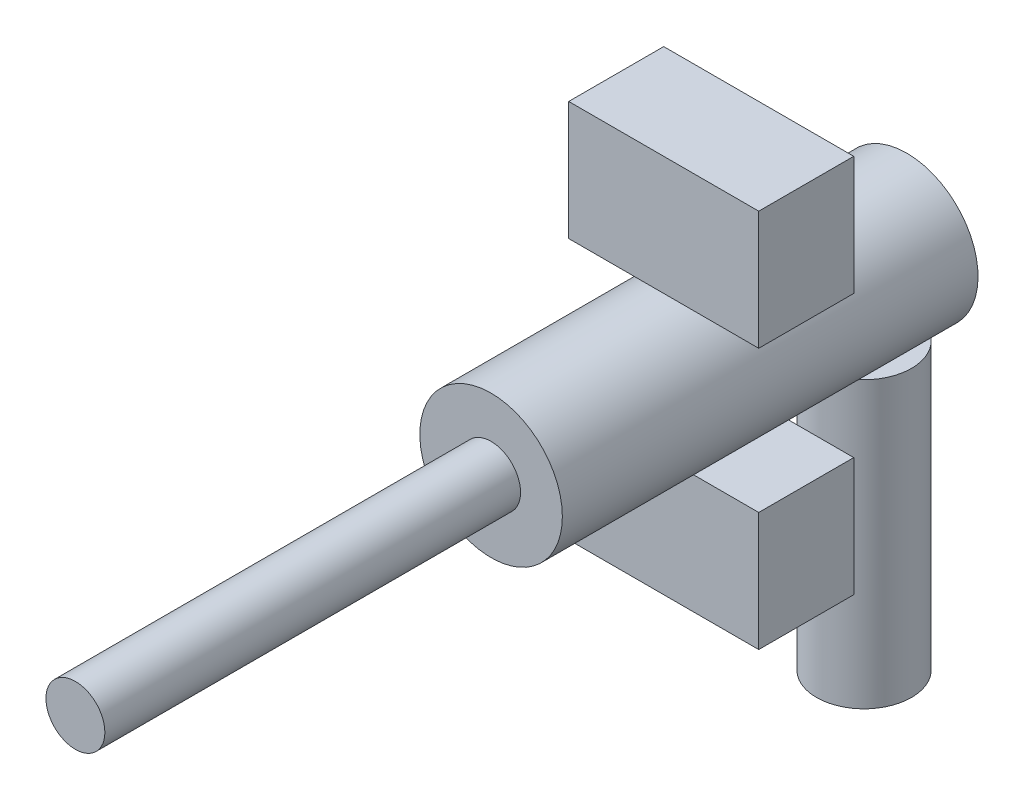
ISO-10303-21;
HEADER;
FILE_DESCRIPTION(('STEP AP214'),'2;1');
FILE_NAME('part.step','',(''),(''),'','','');
FILE_SCHEMA(('AUTOMOTIVE_DESIGN { 1 0 10303 214 1 1 1 1 }'));
ENDSEC;
DATA;
#1=APPLICATION_CONTEXT('core data for automotive mechanical design processes');
#2=APPLICATION_PROTOCOL_DEFINITION('international standard','automotive_design',2000,#1);
#3=PRODUCT_CONTEXT('',#1,'mechanical');
#4=PRODUCT('Part','Part','',(#3));
#5=PRODUCT_RELATED_PRODUCT_CATEGORY('part','',(#4));
#6=PRODUCT_DEFINITION_FORMATION('','',#4);
#7=PRODUCT_DEFINITION_CONTEXT('part definition',#1,'design');
#8=PRODUCT_DEFINITION('design','',#6,#7);
#9=PRODUCT_DEFINITION_SHAPE('','',#8);
#10=(LENGTH_UNIT() NAMED_UNIT(*) SI_UNIT(.MILLI.,.METRE.));
#11=(NAMED_UNIT(*) PLANE_ANGLE_UNIT() SI_UNIT($,.RADIAN.));
#12=(NAMED_UNIT(*) SI_UNIT($,.STERADIAN.) SOLID_ANGLE_UNIT());
#13=UNCERTAINTY_MEASURE_WITH_UNIT(LENGTH_MEASURE(1.E-05),#10,'distance_accuracy_value','');
#14=(GEOMETRIC_REPRESENTATION_CONTEXT(3) GLOBAL_UNCERTAINTY_ASSIGNED_CONTEXT((#13)) GLOBAL_UNIT_ASSIGNED_CONTEXT((#10,
#11,#12)) REPRESENTATION_CONTEXT('',''));
#15=CARTESIAN_POINT('',(0.,0.,0.));
#16=DIRECTION('',(0.,0.,1.));
#17=DIRECTION('',(1.,0.,0.));
#18=AXIS2_PLACEMENT_3D('',#15,#16,#17);
#19=CARTESIAN_POINT('',(-40.,179.48753108507,102.321831747482));
#20=DIRECTION('',(0.,0.,1.));
#21=DIRECTION('',(1.,0.,0.));
#22=AXIS2_PLACEMENT_3D('',#19,#20,#21);
#23=PLANE('',#22);
#24=DIRECTION('',(1.,0.,0.));
#25=VECTOR('',#24,1.);
#26=CARTESIAN_POINT('',(-40.,179.48753108507,102.321831747482));
#27=LINE('',#26,#25);
#28=CARTESIAN_POINT('',(-40.,179.48753108507,102.321831747482));
#29=VERTEX_POINT('',#28);
#30=CARTESIAN_POINT('',(40.,179.48753108507,102.321831747482));
#31=VERTEX_POINT('',#30);
#32=EDGE_CURVE('E58',#29,#31,#27,.T.);
#33=ORIENTED_EDGE('',*,*,#32,.T.);
#34=DIRECTION('',(0.,-1.,0.));
#35=VECTOR('',#34,1.);
#36=CARTESIAN_POINT('',(40.,179.48753108507,102.321831747482));
#37=LINE('',#36,#35);
#38=CARTESIAN_POINT('',(40.,229.48753108507,102.321831747482));
#39=VERTEX_POINT('',#38);
#40=EDGE_CURVE('E95',#39,#31,#37,.T.);
#41=ORIENTED_EDGE('',*,*,#40,.F.);
#42=DIRECTION('',(1.,0.,0.));
#43=VECTOR('',#42,1.);
#44=CARTESIAN_POINT('',(-40.,229.48753108507,102.321831747482));
#45=LINE('',#44,#43);
#46=CARTESIAN_POINT('',(-40.,229.48753108507,102.321831747482));
#47=VERTEX_POINT('',#46);
#48=EDGE_CURVE('E12',#47,#39,#45,.T.);
#49=ORIENTED_EDGE('',*,*,#48,.F.);
#50=DIRECTION('',(0.,-1.,0.));
#51=VECTOR('',#50,1.);
#52=CARTESIAN_POINT('',(-40.,179.48753108507,102.321831747482));
#53=LINE('',#52,#51);
#54=EDGE_CURVE('E96',#47,#29,#53,.T.);
#55=ORIENTED_EDGE('',*,*,#54,.T.);
#56=EDGE_LOOP('',(#33,#41,#49,#55));
#57=FACE_BOUND('',#56,.T.);
#58=ADVANCED_FACE('F55',(#57),#23,.T.);
#59=CARTESIAN_POINT('',(-40.,229.48753108507,102.321831747482));
#60=DIRECTION('',(0.,1.,0.));
#61=DIRECTION('',(0.,0.,1.));
#62=AXIS2_PLACEMENT_3D('',#59,#60,#61);
#63=PLANE('',#62);
#64=ORIENTED_EDGE('',*,*,#48,.T.);
#65=DIRECTION('',(0.,0.,1.));
#66=VECTOR('',#65,1.);
#67=CARTESIAN_POINT('',(40.,229.48753108507,102.321831747482));
#68=LINE('',#67,#66);
#69=CARTESIAN_POINT('',(40.,229.48753108507,62.3218317474823));
#70=VERTEX_POINT('',#69);
#71=EDGE_CURVE('E112',#70,#39,#68,.T.);
#72=ORIENTED_EDGE('',*,*,#71,.F.);
#73=DIRECTION('',(1.,0.,0.));
#74=VECTOR('',#73,1.);
#75=CARTESIAN_POINT('',(-40.,229.48753108507,62.3218317474823));
#76=LINE('',#75,#74);
#77=CARTESIAN_POINT('',(-40.,229.48753108507,62.3218317474823));
#78=VERTEX_POINT('',#77);
#79=EDGE_CURVE('E63',#78,#70,#76,.T.);
#80=ORIENTED_EDGE('',*,*,#79,.F.);
#81=DIRECTION('',(0.,0.,1.));
#82=VECTOR('',#81,1.);
#83=CARTESIAN_POINT('',(-40.,229.48753108507,102.321831747482));
#84=LINE('',#83,#82);
#85=EDGE_CURVE('E101',#78,#47,#84,.T.);
#86=ORIENTED_EDGE('',*,*,#85,.T.);
#87=EDGE_LOOP('',(#64,#72,#80,#86));
#88=FACE_BOUND('',#87,.T.);
#89=ADVANCED_FACE('F127',(#88),#63,.T.);
#90=CARTESIAN_POINT('',(-40.,179.48753108507,62.3218317474823));
#91=DIRECTION('',(0.,0.,-1.));
#92=DIRECTION('',(-1.,0.,0.));
#93=AXIS2_PLACEMENT_3D('',#90,#91,#92);
#94=PLANE('',#93);
#95=ORIENTED_EDGE('',*,*,#79,.T.);
#96=DIRECTION('',(0.,1.,0.));
#97=VECTOR('',#96,1.);
#98=CARTESIAN_POINT('',(40.,179.48753108507,62.3218317474823));
#99=LINE('',#98,#97);
#100=CARTESIAN_POINT('',(40.,179.48753108507,62.3218317474823));
#101=VERTEX_POINT('',#100);
#102=EDGE_CURVE('E108',#101,#70,#99,.T.);
#103=ORIENTED_EDGE('',*,*,#102,.F.);
#104=DIRECTION('',(1.,0.,0.));
#105=VECTOR('',#104,1.);
#106=CARTESIAN_POINT('',(-40.,179.48753108507,62.3218317474823));
#107=LINE('',#106,#105);
#108=CARTESIAN_POINT('',(-40.,179.48753108507,62.3218317474823));
#109=VERTEX_POINT('',#108);
#110=EDGE_CURVE('E100',#109,#101,#107,.T.);
#111=ORIENTED_EDGE('',*,*,#110,.F.);
#112=DIRECTION('',(0.,1.,0.));
#113=VECTOR('',#112,1.);
#114=CARTESIAN_POINT('',(-40.,179.48753108507,62.3218317474823));
#115=LINE('',#114,#113);
#116=EDGE_CURVE('E120',#109,#78,#115,.T.);
#117=ORIENTED_EDGE('',*,*,#116,.T.);
#118=EDGE_LOOP('',(#95,#103,#111,#117));
#119=FACE_BOUND('',#118,.T.);
#120=ADVANCED_FACE('F124',(#119),#94,.T.);
#121=CARTESIAN_POINT('',(-40.,179.48753108507,102.321831747482));
#122=DIRECTION('',(0.,-1.,0.));
#123=DIRECTION('',(0.,0.,-1.));
#124=AXIS2_PLACEMENT_3D('',#121,#122,#123);
#125=PLANE('',#124);
#126=ORIENTED_EDGE('',*,*,#110,.T.);
#127=DIRECTION('',(0.,0.,-1.));
#128=VECTOR('',#127,1.);
#129=CARTESIAN_POINT('',(40.,179.48753108507,102.321831747482));
#130=LINE('',#129,#128);
#131=EDGE_CURVE('E103',#31,#101,#130,.T.);
#132=ORIENTED_EDGE('',*,*,#131,.F.);
#133=ORIENTED_EDGE('',*,*,#32,.F.);
#134=DIRECTION('',(0.,0.,-1.));
#135=VECTOR('',#134,1.);
#136=CARTESIAN_POINT('',(-40.,179.48753108507,102.321831747482));
#137=LINE('',#136,#135);
#138=EDGE_CURVE('E118',#29,#109,#137,.T.);
#139=ORIENTED_EDGE('',*,*,#138,.T.);
#140=EDGE_LOOP('',(#126,#132,#133,#139));
#141=FACE_BOUND('',#140,.T.);
#142=ADVANCED_FACE('F104',(#141),#125,.T.);
#143=CARTESIAN_POINT('',(-40.,0.,0.));
#144=DIRECTION('',(-1.,0.,0.));
#145=DIRECTION('',(0.,0.,1.));
#146=AXIS2_PLACEMENT_3D('',#143,#144,#145);
#147=PLANE('',#146);
#148=ORIENTED_EDGE('',*,*,#54,.F.);
#149=ORIENTED_EDGE('',*,*,#85,.F.);
#150=ORIENTED_EDGE('',*,*,#116,.F.);
#151=ORIENTED_EDGE('',*,*,#138,.F.);
#152=EDGE_LOOP('',(#148,#149,#150,#151));
#153=FACE_BOUND('',#152,.T.);
#154=ADVANCED_FACE('F129',(#153),#147,.T.);
#155=CARTESIAN_POINT('',(40.,0.,0.));
#156=DIRECTION('',(-1.,0.,0.));
#157=DIRECTION('',(0.,0.,1.));
#158=AXIS2_PLACEMENT_3D('',#155,#156,#157);
#159=PLANE('',#158);
#160=ORIENTED_EDGE('',*,*,#40,.T.);
#161=ORIENTED_EDGE('',*,*,#131,.T.);
#162=ORIENTED_EDGE('',*,*,#102,.T.);
#163=ORIENTED_EDGE('',*,*,#71,.T.);
#164=EDGE_LOOP('',(#160,#161,#162,#163));
#165=FACE_BOUND('',#164,.T.);
#166=ADVANCED_FACE('F111',(#165),#159,.F.);
#167=CLOSED_SHELL('',(#58,#89,#120,#142,#154,#166));
#168=MANIFOLD_SOLID_BREP('B2',#167);
#169=CARTESIAN_POINT('',(0.,120.,17.9882332348629));
#170=DIRECTION('',(0.,-1.,0.));
#171=DIRECTION('',(0.,0.,-1.));
#172=AXIS2_PLACEMENT_3D('',#169,#170,#171);
#173=CYLINDRICAL_SURFACE('',#172,20.);
#174=CARTESIAN_POINT('',(0.,0.,17.9882332348629));
#175=DIRECTION('',(0.,1.,0.));
#176=DIRECTION('',(0.,0.,1.));
#177=AXIS2_PLACEMENT_3D('',#174,#175,#176);
#178=CIRCLE('',#177,20.);
#179=CARTESIAN_POINT('',(0.,0.,37.9882332348629));
#180=VERTEX_POINT('',#179);
#181=EDGE_CURVE('E321',#180,#180,#178,.T.);
#182=ORIENTED_EDGE('',*,*,#181,.T.);
#183=EDGE_LOOP('',(#182));
#184=FACE_BOUND('',#183,.T.);
#185=CARTESIAN_POINT('',(-5.52136853570222,120.,37.2109929090865));
#186=CARTESIAN_POINT('',(-5.29193302138808,119.957037804867,37.2768943103946));
#187=CARTESIAN_POINT('',(-5.06091253679001,119.916554845313,37.3388024333484));
#188=CARTESIAN_POINT('',(-4.59598902122757,119.840737590571,37.45446777266));
#189=CARTESIAN_POINT('',(-4.36208580677418,119.805403624977,37.5082244672428));
#190=CARTESIAN_POINT('',(-3.65650935186533,119.707415802089,37.657012798175));
#191=CARTESIAN_POINT('',(-3.18098714133821,119.652779380687,37.7395575443784));
#192=CARTESIAN_POINT('',(-2.23648701823118,119.567357095238,37.8683503241664));
#193=CARTESIAN_POINT('',(-1.76769162302292,119.535953618657,37.9155387256518));
#194=CARTESIAN_POINT('',(-0.827057573782967,119.495240836377,37.9766799810276));
#195=CARTESIAN_POINT('',(-0.355219623911195,119.485926590303,37.9906402665685));
#196=CARTESIAN_POINT('',(0.569300120255673,119.489514564927,37.9852577339645));
#197=CARTESIAN_POINT('',(1.02199373849564,119.501543628949,37.9672238052882));
#198=CARTESIAN_POINT('',(1.92417509509118,119.545894783714,37.9005962290482));
#199=CARTESIAN_POINT('',(2.37366234055385,119.578219929223,37.8519979812443));
#200=CARTESIAN_POINT('',(3.27874165463821,119.663681644793,37.7230855988506));
#201=CARTESIAN_POINT('',(3.73416545758765,119.717362201779,37.641941952275));
#202=CARTESIAN_POINT('',(4.41014591507068,119.812584102018,37.4973022562262));
#203=CARTESIAN_POINT('',(4.63428007047814,119.8467748898,37.44526835514));
#204=CARTESIAN_POINT('',(5.07988498020442,119.919884182736,37.3337108859222));
#205=CARTESIAN_POINT('',(5.3013558830419,119.958802422903,37.2741877375769));
#206=CARTESIAN_POINT('',(5.52136853570222,120.,37.2109929090865));
#207=B_SPLINE_CURVE_WITH_KNOTS('',3,(#185,#186,#187,#188,#189,#190,#191,#192,#193,#194,#195,
#196,#197,#198,#199,#200,#201,#202,#203,#204,#205,#206),.UNSPECIFIED.,.F.,.F.,(4,2,2,2,2,2,2,2,
2,2,4),(0.,0.727539342602564,1.45512523556241,2.91035344813136,4.32535051133285,
5.74003107292185,7.09816389103255,8.45650117085002,9.85191582673059,10.5496223790287,
11.2472898409633),.UNSPECIFIED.);
#208=CARTESIAN_POINT('',(-5.52136853570222,120.,37.2109929090865));
#209=VERTEX_POINT('',#208);
#210=CARTESIAN_POINT('',(5.52136853570222,120.,37.2109929090865));
#211=VERTEX_POINT('',#210);
#212=EDGE_CURVE('E311',#209,#211,#207,.T.);
#213=ORIENTED_EDGE('',*,*,#212,.F.);
#214=CARTESIAN_POINT('',(0.,120.,17.9882332348629));
#215=DIRECTION('',(0.,1.,0.));
#216=DIRECTION('',(0.,0.,1.));
#217=AXIS2_PLACEMENT_3D('',#214,#215,#216);
#218=CIRCLE('',#217,20.);
#219=EDGE_CURVE('E322',#211,#209,#218,.T.);
#220=ORIENTED_EDGE('',*,*,#219,.F.);
#221=EDGE_LOOP('',(#213,#220));
#222=FACE_BOUND('',#221,.T.);
#223=ADVANCED_FACE('F179',(#184,#222),#173,.T.);
#224=CARTESIAN_POINT('',(0.,120.,17.9882332348629));
#225=DIRECTION('',(0.,1.,0.));
#226=DIRECTION('',(0.,0.,1.));
#227=AXIS2_PLACEMENT_3D('',#224,#225,#226);
#228=PLANE('',#227);
#229=DIRECTION('',(1.,0.,0.));
#230=VECTOR('',#229,1.);
#231=CARTESIAN_POINT('',(0.,120.,0.));
#232=LINE('',#231,#230);
#233=CARTESIAN_POINT('',(-5.52136853570222,120.,0.));
#234=VERTEX_POINT('',#233);
#235=CARTESIAN_POINT('',(5.52136853570222,120.,0.));
#236=VERTEX_POINT('',#235);
#237=EDGE_CURVE('E357',#234,#236,#232,.T.);
#238=ORIENTED_EDGE('',*,*,#237,.T.);
#239=DIRECTION('',(0.,0.,-1.));
#240=VECTOR('',#239,1.);
#241=CARTESIAN_POINT('',(5.52136853570222,120.,175.));
#242=LINE('',#241,#240);
#243=EDGE_CURVE('E306',#236,#211,#242,.F.);
#244=ORIENTED_EDGE('',*,*,#243,.T.);
#245=ORIENTED_EDGE('',*,*,#219,.T.);
#246=DIRECTION('',(0.,0.,-1.));
#247=VECTOR('',#246,1.);
#248=CARTESIAN_POINT('',(-5.52136853570222,120.,175.));
#249=LINE('',#248,#247);
#250=EDGE_CURVE('E355',#209,#234,#249,.T.);
#251=ORIENTED_EDGE('',*,*,#250,.T.);
#252=EDGE_LOOP('',(#238,#244,#245,#251));
#253=FACE_BOUND('',#252,.T.);
#254=ADVANCED_FACE('F334',(#253),#228,.T.);
#255=CARTESIAN_POINT('',(0.,0.,17.9882332348629));
#256=DIRECTION('',(0.,1.,0.));
#257=DIRECTION('',(0.,0.,1.));
#258=AXIS2_PLACEMENT_3D('',#255,#256,#257);
#259=PLANE('',#258);
#260=ORIENTED_EDGE('',*,*,#181,.F.);
#261=EDGE_LOOP('',(#260));
#262=FACE_BOUND('',#261,.T.);
#263=ADVANCED_FACE('F330',(#262),#259,.F.);
#264=CARTESIAN_POINT('',(0.,149.48753108507,175.));
#265=DIRECTION('',(0.,0.,-1.));
#266=DIRECTION('',(-1.,0.,0.));
#267=AXIS2_PLACEMENT_3D('',#264,#265,#266);
#268=CYLINDRICAL_SURFACE('',#267,30.);
#269=DIRECTION('',(0.,0.,-1.));
#270=VECTOR('',#269,1.);
#271=CARTESIAN_POINT('',(-3.03737003392138,119.641687433448,175.));
#272=LINE('',#271,#270);
#273=CARTESIAN_POINT('',(-3.03737003392138,119.641687433448,62.3218317474823));
#274=VERTEX_POINT('',#273);
#275=CARTESIAN_POINT('',(-3.03737003392138,119.641687433448,102.321831747482));
#276=VERTEX_POINT('',#275);
#277=EDGE_CURVE('E369',#274,#276,#272,.F.);
#278=ORIENTED_EDGE('',*,*,#277,.T.);
#279=CARTESIAN_POINT('',(0.,149.48753108507,102.321831747482));
#280=DIRECTION('',(0.,0.,1.));
#281=DIRECTION('',(1.,0.,0.));
#282=AXIS2_PLACEMENT_3D('',#279,#280,#281);
#283=CIRCLE('',#282,30.);
#284=CARTESIAN_POINT('',(3.03737003392138,119.641687433448,102.321831747482));
#285=VERTEX_POINT('',#284);
#286=EDGE_CURVE('E53',#276,#285,#283,.T.);
#287=ORIENTED_EDGE('',*,*,#286,.T.);
#288=DIRECTION('',(0.,0.,-1.));
#289=VECTOR('',#288,1.);
#290=CARTESIAN_POINT('',(3.03737003392138,119.641687433448,175.));
#291=LINE('',#290,#289);
#292=CARTESIAN_POINT('',(3.03737003392138,119.641687433448,62.3218317474823));
#293=VERTEX_POINT('',#292);
#294=EDGE_CURVE('E188',#285,#293,#291,.T.);
#295=ORIENTED_EDGE('',*,*,#294,.T.);
#296=CARTESIAN_POINT('',(0.,149.48753108507,62.3218317474823));
#297=DIRECTION('',(0.,0.,-1.));
#298=DIRECTION('',(-1.,0.,0.));
#299=AXIS2_PLACEMENT_3D('',#296,#297,#298);
#300=CIRCLE('',#299,30.);
#301=EDGE_CURVE('E305',#293,#274,#300,.T.);
#302=ORIENTED_EDGE('',*,*,#301,.T.);
#303=EDGE_LOOP('',(#278,#287,#295,#302));
#304=FACE_BOUND('',#303,.T.);
#305=ORIENTED_EDGE('',*,*,#243,.F.);
#306=CARTESIAN_POINT('',(0.,149.48753108507,0.));
#307=DIRECTION('',(0.,0.,1.));
#308=DIRECTION('',(1.,0.,0.));
#309=AXIS2_PLACEMENT_3D('',#306,#307,#308);
#310=CIRCLE('',#309,30.);
#311=EDGE_CURVE('E202',#236,#234,#310,.T.);
#312=ORIENTED_EDGE('',*,*,#311,.T.);
#313=ORIENTED_EDGE('',*,*,#250,.F.);
#314=ORIENTED_EDGE('',*,*,#212,.T.);
#315=EDGE_LOOP('',(#305,#312,#313,#314));
#316=FACE_BOUND('',#315,.T.);
#317=CARTESIAN_POINT('',(0.,149.48753108507,175.));
#318=DIRECTION('',(0.,0.,1.));
#319=DIRECTION('',(1.,0.,0.));
#320=AXIS2_PLACEMENT_3D('',#317,#318,#319);
#321=CIRCLE('',#320,30.);
#322=CARTESIAN_POINT('',(30.,149.48753108507,175.));
#323=VERTEX_POINT('',#322);
#324=EDGE_CURVE('E307',#323,#323,#321,.T.);
#325=ORIENTED_EDGE('',*,*,#324,.F.);
#326=EDGE_LOOP('',(#325));
#327=FACE_BOUND('',#326,.T.);
#328=ADVANCED_FACE('F324',(#304,#316,#327),#268,.T.);
#329=CARTESIAN_POINT('',(0.,149.48753108507,175.));
#330=DIRECTION('',(0.,0.,1.));
#331=DIRECTION('',(1.,0.,0.));
#332=AXIS2_PLACEMENT_3D('',#329,#330,#331);
#333=PLANE('',#332);
#334=CARTESIAN_POINT('',(0.,149.48753108507,175.));
#335=DIRECTION('',(0.,0.,1.));
#336=DIRECTION('',(1.,0.,0.));
#337=AXIS2_PLACEMENT_3D('',#334,#335,#336);
#338=CIRCLE('',#337,12.4009204125942);
#339=CARTESIAN_POINT('',(12.4009204125942,149.48753108507,175.));
#340=VERTEX_POINT('',#339);
#341=EDGE_CURVE('E301',#340,#340,#338,.T.);
#342=ORIENTED_EDGE('',*,*,#341,.F.);
#343=EDGE_LOOP('',(#342));
#344=FACE_BOUND('',#343,.T.);
#345=ORIENTED_EDGE('',*,*,#324,.T.);
#346=EDGE_LOOP('',(#345));
#347=FACE_BOUND('',#346,.T.);
#348=ADVANCED_FACE('F329',(#344,#347),#333,.T.);
#349=CARTESIAN_POINT('',(0.,149.48753108507,0.));
#350=DIRECTION('',(0.,0.,1.));
#351=DIRECTION('',(1.,0.,0.));
#352=AXIS2_PLACEMENT_3D('',#349,#350,#351);
#353=PLANE('',#352);
#354=ORIENTED_EDGE('',*,*,#237,.F.);
#355=ORIENTED_EDGE('',*,*,#311,.F.);
#356=EDGE_LOOP('',(#354,#355));
#357=FACE_BOUND('',#356,.T.);
#358=ADVANCED_FACE('F332',(#357),#353,.F.);
#359=CARTESIAN_POINT('',(0.,149.48753108507,350.));
#360=DIRECTION('',(0.,0.,-1.));
#361=DIRECTION('',(-1.,0.,0.));
#362=AXIS2_PLACEMENT_3D('',#359,#360,#361);
#363=CYLINDRICAL_SURFACE('',#362,12.4009204125942);
#364=CARTESIAN_POINT('',(0.,149.48753108507,350.));
#365=DIRECTION('',(0.,0.,1.));
#366=DIRECTION('',(1.,0.,0.));
#367=AXIS2_PLACEMENT_3D('',#364,#365,#366);
#368=CIRCLE('',#367,12.4009204125942);
#369=CARTESIAN_POINT('',(12.4009204125942,149.48753108507,350.));
#370=VERTEX_POINT('',#369);
#371=EDGE_CURVE('E297',#370,#370,#368,.T.);
#372=ORIENTED_EDGE('',*,*,#371,.F.);
#373=EDGE_LOOP('',(#372));
#374=FACE_BOUND('',#373,.T.);
#375=ORIENTED_EDGE('',*,*,#341,.T.);
#376=EDGE_LOOP('',(#375));
#377=FACE_BOUND('',#376,.T.);
#378=ADVANCED_FACE('F408',(#374,#377),#363,.T.);
#379=CARTESIAN_POINT('',(0.,149.48753108507,350.));
#380=DIRECTION('',(0.,0.,1.));
#381=DIRECTION('',(1.,0.,0.));
#382=AXIS2_PLACEMENT_3D('',#379,#380,#381);
#383=PLANE('',#382);
#384=ORIENTED_EDGE('',*,*,#371,.T.);
#385=EDGE_LOOP('',(#384));
#386=FACE_BOUND('',#385,.T.);
#387=ADVANCED_FACE('F401',(#386),#383,.T.);
#388=CARTESIAN_POINT('',(-40.,119.641687433448,102.321831747482));
#389=DIRECTION('',(0.,1.,0.));
#390=DIRECTION('',(0.,0.,1.));
#391=AXIS2_PLACEMENT_3D('',#388,#389,#390);
#392=PLANE('',#391);
#393=ORIENTED_EDGE('',*,*,#294,.F.);
#394=DIRECTION('',(1.,0.,0.));
#395=VECTOR('',#394,1.);
#396=CARTESIAN_POINT('',(-40.,119.641687433448,102.321831747482));
#397=LINE('',#396,#395);
#398=CARTESIAN_POINT('',(40.,119.641687433448,102.321831747482));
#399=VERTEX_POINT('',#398);
#400=EDGE_CURVE('E255',#285,#399,#397,.T.);
#401=ORIENTED_EDGE('',*,*,#400,.T.);
#402=DIRECTION('',(0.,0.,1.));
#403=VECTOR('',#402,1.);
#404=CARTESIAN_POINT('',(40.,119.641687433448,102.321831747482));
#405=LINE('',#404,#403);
#406=CARTESIAN_POINT('',(40.,119.641687433448,62.3218317474823));
#407=VERTEX_POINT('',#406);
#408=EDGE_CURVE('E266',#407,#399,#405,.T.);
#409=ORIENTED_EDGE('',*,*,#408,.F.);
#410=DIRECTION('',(1.,0.,0.));
#411=VECTOR('',#410,1.);
#412=CARTESIAN_POINT('',(-40.,119.641687433448,62.3218317474823));
#413=LINE('',#412,#411);
#414=EDGE_CURVE('E254',#293,#407,#413,.T.);
#415=ORIENTED_EDGE('',*,*,#414,.F.);
#416=EDGE_LOOP('',(#393,#401,#409,#415));
#417=FACE_BOUND('',#416,.T.);
#418=ADVANCED_FACE('F375',(#417),#392,.T.);
#419=ORIENTED_EDGE('',*,*,#277,.F.);
#420=CARTESIAN_POINT('',(-40.,119.641687433448,62.3218317474823));
#421=VERTEX_POINT('',#420);
#422=EDGE_CURVE('E195',#421,#274,#413,.T.);
#423=ORIENTED_EDGE('',*,*,#422,.F.);
#424=DIRECTION('',(0.,0.,1.));
#425=VECTOR('',#424,1.);
#426=CARTESIAN_POINT('',(-40.,119.641687433448,102.321831747482));
#427=LINE('',#426,#425);
#428=CARTESIAN_POINT('',(-40.,119.641687433448,102.321831747482));
#429=VERTEX_POINT('',#428);
#430=EDGE_CURVE('E262',#421,#429,#427,.T.);
#431=ORIENTED_EDGE('',*,*,#430,.T.);
#432=EDGE_CURVE('E245',#429,#276,#397,.T.);
#433=ORIENTED_EDGE('',*,*,#432,.T.);
#434=EDGE_LOOP('',(#419,#423,#431,#433));
#435=FACE_BOUND('',#434,.T.);
#436=ADVANCED_FACE('F268',(#435),#392,.T.);
#437=CARTESIAN_POINT('',(-40.,119.641687433448,102.321831747482));
#438=DIRECTION('',(0.,0.,1.));
#439=DIRECTION('',(1.,0.,0.));
#440=AXIS2_PLACEMENT_3D('',#437,#438,#439);
#441=PLANE('',#440);
#442=ORIENTED_EDGE('',*,*,#286,.F.);
#443=ORIENTED_EDGE('',*,*,#432,.F.);
#444=DIRECTION('',(0.,-1.,0.));
#445=VECTOR('',#444,1.);
#446=CARTESIAN_POINT('',(-40.,119.641687433448,102.321831747482));
#447=LINE('',#446,#445);
#448=CARTESIAN_POINT('',(-40.,69.6416874334483,102.321831747482));
#449=VERTEX_POINT('',#448);
#450=EDGE_CURVE('E248',#429,#449,#447,.T.);
#451=ORIENTED_EDGE('',*,*,#450,.T.);
#452=DIRECTION('',(1.,0.,0.));
#453=VECTOR('',#452,1.);
#454=CARTESIAN_POINT('',(-40.,69.6416874334483,102.321831747482));
#455=LINE('',#454,#453);
#456=CARTESIAN_POINT('',(40.,69.6416874334483,102.321831747482));
#457=VERTEX_POINT('',#456);
#458=EDGE_CURVE('E271',#449,#457,#455,.T.);
#459=ORIENTED_EDGE('',*,*,#458,.T.);
#460=DIRECTION('',(0.,-1.,0.));
#461=VECTOR('',#460,1.);
#462=CARTESIAN_POINT('',(40.,119.641687433448,102.321831747482));
#463=LINE('',#462,#461);
#464=EDGE_CURVE('E293',#399,#457,#463,.T.);
#465=ORIENTED_EDGE('',*,*,#464,.F.);
#466=ORIENTED_EDGE('',*,*,#400,.F.);
#467=EDGE_LOOP('',(#442,#443,#451,#459,#465,#466));
#468=FACE_BOUND('',#467,.T.);
#469=ADVANCED_FACE('F247',(#468),#441,.T.);
#470=CARTESIAN_POINT('',(-40.,119.641687433448,62.3218317474823));
#471=DIRECTION('',(0.,0.,-1.));
#472=DIRECTION('',(-1.,0.,0.));
#473=AXIS2_PLACEMENT_3D('',#470,#471,#472);
#474=PLANE('',#473);
#475=ORIENTED_EDGE('',*,*,#301,.F.);
#476=ORIENTED_EDGE('',*,*,#414,.T.);
#477=DIRECTION('',(0.,1.,0.));
#478=VECTOR('',#477,1.);
#479=CARTESIAN_POINT('',(40.,119.641687433448,62.3218317474823));
#480=LINE('',#479,#478);
#481=CARTESIAN_POINT('',(40.,69.6416874334483,62.3218317474823));
#482=VERTEX_POINT('',#481);
#483=EDGE_CURVE('E285',#482,#407,#480,.T.);
#484=ORIENTED_EDGE('',*,*,#483,.F.);
#485=DIRECTION('',(1.,0.,0.));
#486=VECTOR('',#485,1.);
#487=CARTESIAN_POINT('',(-40.,69.6416874334483,62.3218317474823));
#488=LINE('',#487,#486);
#489=CARTESIAN_POINT('',(-40.,69.6416874334483,62.3218317474823));
#490=VERTEX_POINT('',#489);
#491=EDGE_CURVE('E276',#490,#482,#488,.T.);
#492=ORIENTED_EDGE('',*,*,#491,.F.);
#493=DIRECTION('',(0.,1.,0.));
#494=VECTOR('',#493,1.);
#495=CARTESIAN_POINT('',(-40.,119.641687433448,62.3218317474823));
#496=LINE('',#495,#494);
#497=EDGE_CURVE('E270',#490,#421,#496,.T.);
#498=ORIENTED_EDGE('',*,*,#497,.T.);
#499=ORIENTED_EDGE('',*,*,#422,.T.);
#500=EDGE_LOOP('',(#475,#476,#484,#492,#498,#499));
#501=FACE_BOUND('',#500,.T.);
#502=ADVANCED_FACE('F389',(#501),#474,.T.);
#503=CARTESIAN_POINT('',(-40.,69.6416874334483,102.321831747482));
#504=DIRECTION('',(0.,-1.,0.));
#505=DIRECTION('',(0.,0.,-1.));
#506=AXIS2_PLACEMENT_3D('',#503,#504,#505);
#507=PLANE('',#506);
#508=ORIENTED_EDGE('',*,*,#491,.T.);
#509=DIRECTION('',(0.,0.,-1.));
#510=VECTOR('',#509,1.);
#511=CARTESIAN_POINT('',(40.,69.6416874334483,102.321831747482));
#512=LINE('',#511,#510);
#513=EDGE_CURVE('E289',#457,#482,#512,.T.);
#514=ORIENTED_EDGE('',*,*,#513,.F.);
#515=ORIENTED_EDGE('',*,*,#458,.F.);
#516=DIRECTION('',(0.,0.,-1.));
#517=VECTOR('',#516,1.);
#518=CARTESIAN_POINT('',(-40.,69.6416874334483,102.321831747482));
#519=LINE('',#518,#517);
#520=EDGE_CURVE('E264',#449,#490,#519,.T.);
#521=ORIENTED_EDGE('',*,*,#520,.T.);
#522=EDGE_LOOP('',(#508,#514,#515,#521));
#523=FACE_BOUND('',#522,.T.);
#524=ADVANCED_FACE('F385',(#523),#507,.T.);
#525=CARTESIAN_POINT('',(-40.,0.,0.));
#526=DIRECTION('',(1.,0.,0.));
#527=DIRECTION('',(0.,0.,-1.));
#528=AXIS2_PLACEMENT_3D('',#525,#526,#527);
#529=PLANE('',#528);
#530=ORIENTED_EDGE('',*,*,#450,.F.);
#531=ORIENTED_EDGE('',*,*,#430,.F.);
#532=ORIENTED_EDGE('',*,*,#497,.F.);
#533=ORIENTED_EDGE('',*,*,#520,.F.);
#534=EDGE_LOOP('',(#530,#531,#532,#533));
#535=FACE_BOUND('',#534,.T.);
#536=ADVANCED_FACE('F260',(#535),#529,.F.);
#537=CARTESIAN_POINT('',(40.,0.,0.));
#538=DIRECTION('',(1.,0.,0.));
#539=DIRECTION('',(0.,0.,-1.));
#540=AXIS2_PLACEMENT_3D('',#537,#538,#539);
#541=PLANE('',#540);
#542=ORIENTED_EDGE('',*,*,#464,.T.);
#543=ORIENTED_EDGE('',*,*,#513,.T.);
#544=ORIENTED_EDGE('',*,*,#483,.T.);
#545=ORIENTED_EDGE('',*,*,#408,.T.);
#546=EDGE_LOOP('',(#542,#543,#544,#545));
#547=FACE_BOUND('',#546,.T.);
#548=ADVANCED_FACE('F388',(#547),#541,.T.);
#549=CLOSED_SHELL('',(#223,#254,#263,#328,#348,#358,#378,#387,#418,#436,#469,#502,#524,#536,#548));
#550=MANIFOLD_SOLID_BREP('B6',#549);
#551=ADVANCED_BREP_SHAPE_REPRESENTATION('',(#18,#168,#550),#14);
#552=SHAPE_DEFINITION_REPRESENTATION(#9,#551);
ENDSEC;
END-ISO-10303-21;
